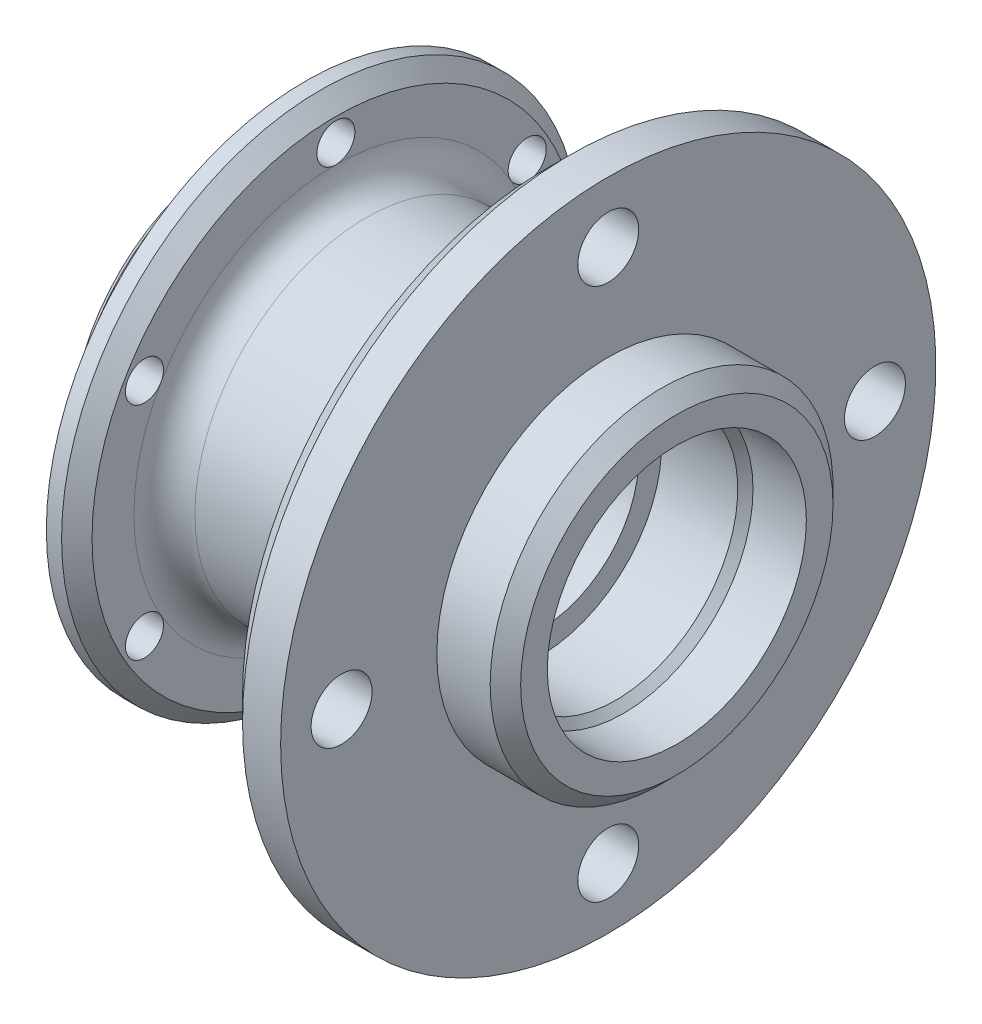
ISO-10303-21;
HEADER;
FILE_DESCRIPTION(('STEP AP214'),'2;1');
FILE_NAME('part.step','',(''),(''),'','','');
FILE_SCHEMA(('AUTOMOTIVE_DESIGN { 1 0 10303 214 1 1 1 1 }'));
ENDSEC;
DATA;
#1=APPLICATION_CONTEXT('core data for automotive mechanical design processes');
#2=APPLICATION_PROTOCOL_DEFINITION('international standard','automotive_design',2000,#1);
#3=PRODUCT_CONTEXT('',#1,'mechanical');
#4=PRODUCT('Part','Part','',(#3));
#5=PRODUCT_RELATED_PRODUCT_CATEGORY('part','',(#4));
#6=PRODUCT_DEFINITION_FORMATION('','',#4);
#7=PRODUCT_DEFINITION_CONTEXT('part definition',#1,'design');
#8=PRODUCT_DEFINITION('design','',#6,#7);
#9=PRODUCT_DEFINITION_SHAPE('','',#8);
#10=(LENGTH_UNIT() NAMED_UNIT(*) SI_UNIT(.MILLI.,.METRE.));
#11=(NAMED_UNIT(*) PLANE_ANGLE_UNIT() SI_UNIT($,.RADIAN.));
#12=(NAMED_UNIT(*) SI_UNIT($,.STERADIAN.) SOLID_ANGLE_UNIT());
#13=UNCERTAINTY_MEASURE_WITH_UNIT(LENGTH_MEASURE(1.E-05),#10,'distance_accuracy_value','');
#14=(GEOMETRIC_REPRESENTATION_CONTEXT(3) GLOBAL_UNCERTAINTY_ASSIGNED_CONTEXT((#13)) GLOBAL_UNIT_ASSIGNED_CONTEXT((#10,
#11,#12)) REPRESENTATION_CONTEXT('',''));
#15=CARTESIAN_POINT('',(0.,0.,0.));
#16=DIRECTION('',(0.,0.,1.));
#17=DIRECTION('',(1.,0.,0.));
#18=AXIS2_PLACEMENT_3D('',#15,#16,#17);
#19=CARTESIAN_POINT('',(-20.8689987087295,34.,0.));
#20=DIRECTION('',(1.,0.,0.));
#21=DIRECTION('',(0.,0.,-1.));
#22=AXIS2_PLACEMENT_3D('',#19,#20,#21);
#23=PLANE('',#22);
#24=CARTESIAN_POINT('',(-20.8689987087295,14.5000000000003,-25.1147367097486));
#25=DIRECTION('',(-1.,0.,0.));
#26=DIRECTION('',(0.,0.,1.));
#27=AXIS2_PLACEMENT_3D('',#24,#25,#26);
#28=CIRCLE('',#27,2.5);
#29=CARTESIAN_POINT('',(-20.8689987087295,14.5000000000003,-22.6147367097486));
#30=VERTEX_POINT('',#29);
#31=EDGE_CURVE('E246',#30,#30,#28,.T.);
#32=ORIENTED_EDGE('',*,*,#31,.F.);
#33=EDGE_LOOP('',(#32));
#34=FACE_BOUND('',#33,.T.);
#35=CARTESIAN_POINT('',(-20.8689987087295,-14.4999999999998,-25.1147367097489));
#36=DIRECTION('',(-1.,0.,0.));
#37=DIRECTION('',(0.,0.,1.));
#38=AXIS2_PLACEMENT_3D('',#35,#36,#37);
#39=CIRCLE('',#38,2.5);
#40=CARTESIAN_POINT('',(-20.8689987087295,-14.4999999999998,-22.6147367097489));
#41=VERTEX_POINT('',#40);
#42=EDGE_CURVE('E242',#41,#41,#39,.T.);
#43=ORIENTED_EDGE('',*,*,#42,.F.);
#44=EDGE_LOOP('',(#43));
#45=FACE_BOUND('',#44,.T.);
#46=CARTESIAN_POINT('',(-20.8689987087295,-29.,0.));
#47=DIRECTION('',(-1.,0.,0.));
#48=DIRECTION('',(0.,0.,1.));
#49=AXIS2_PLACEMENT_3D('',#46,#47,#48);
#50=CIRCLE('',#49,2.5);
#51=CARTESIAN_POINT('',(-20.8689987087295,-29.,2.5));
#52=VERTEX_POINT('',#51);
#53=EDGE_CURVE('E237',#52,#52,#50,.T.);
#54=ORIENTED_EDGE('',*,*,#53,.F.);
#55=EDGE_LOOP('',(#54));
#56=FACE_BOUND('',#55,.T.);
#57=CARTESIAN_POINT('',(-20.8689987087295,-14.5000000000001,25.1147367097487));
#58=DIRECTION('',(-1.,0.,0.));
#59=DIRECTION('',(0.,0.,1.));
#60=AXIS2_PLACEMENT_3D('',#57,#58,#59);
#61=CIRCLE('',#60,2.5);
#62=CARTESIAN_POINT('',(-20.8689987087295,-14.5000000000001,27.6147367097487));
#63=VERTEX_POINT('',#62);
#64=EDGE_CURVE('E229',#63,#63,#61,.T.);
#65=ORIENTED_EDGE('',*,*,#64,.F.);
#66=EDGE_LOOP('',(#65));
#67=FACE_BOUND('',#66,.T.);
#68=CARTESIAN_POINT('',(-20.8689987087295,29.,0.));
#69=DIRECTION('',(-1.,0.,0.));
#70=DIRECTION('',(0.,0.,1.));
#71=AXIS2_PLACEMENT_3D('',#68,#69,#70);
#72=CIRCLE('',#71,2.5);
#73=CARTESIAN_POINT('',(-20.8689987087295,29.,2.5));
#74=VERTEX_POINT('',#73);
#75=EDGE_CURVE('E88',#74,#74,#72,.T.);
#76=ORIENTED_EDGE('',*,*,#75,.F.);
#77=EDGE_LOOP('',(#76));
#78=FACE_BOUND('',#77,.T.);
#79=CARTESIAN_POINT('',(-20.8689987087295,0.,0.));
#80=DIRECTION('',(-1.,0.,0.));
#81=DIRECTION('',(0.,0.,1.));
#82=AXIS2_PLACEMENT_3D('',#79,#80,#81);
#83=CIRCLE('',#82,22.5);
#84=CARTESIAN_POINT('',(-20.8689987087295,0.,22.5));
#85=VERTEX_POINT('',#84);
#86=EDGE_CURVE('E126',#85,#85,#83,.T.);
#87=ORIENTED_EDGE('',*,*,#86,.F.);
#88=EDGE_LOOP('',(#87));
#89=FACE_BOUND('',#88,.T.);
#90=CARTESIAN_POINT('',(-20.8689987087295,0.,0.));
#91=DIRECTION('',(-1.,0.,0.));
#92=DIRECTION('',(0.,0.,1.));
#93=AXIS2_PLACEMENT_3D('',#90,#91,#92);
#94=CIRCLE('',#93,34.);
#95=CARTESIAN_POINT('',(-20.8689987087295,0.,34.));
#96=VERTEX_POINT('',#95);
#97=EDGE_CURVE('E129',#96,#96,#94,.T.);
#98=ORIENTED_EDGE('',*,*,#97,.T.);
#99=EDGE_LOOP('',(#98));
#100=FACE_BOUND('',#99,.T.);
#101=CARTESIAN_POINT('',(-20.8689987087295,14.4999999999999,25.1147367097488));
#102=DIRECTION('',(-1.,0.,0.));
#103=DIRECTION('',(0.,0.,1.));
#104=AXIS2_PLACEMENT_3D('',#101,#102,#103);
#105=CIRCLE('',#104,2.5);
#106=CARTESIAN_POINT('',(-20.8689987087295,14.4999999999999,27.6147367097488));
#107=VERTEX_POINT('',#106);
#108=EDGE_CURVE('E224',#107,#107,#105,.T.);
#109=ORIENTED_EDGE('',*,*,#108,.F.);
#110=EDGE_LOOP('',(#109));
#111=FACE_BOUND('',#110,.T.);
#112=ADVANCED_FACE('F35',(#34,#45,#56,#67,#78,#89,#100,#111),#23,.F.);
#113=CARTESIAN_POINT('',(18.8810012912705,22.5,0.));
#114=DIRECTION('',(-1.,0.,0.));
#115=DIRECTION('',(0.,0.,1.));
#116=AXIS2_PLACEMENT_3D('',#113,#114,#115);
#117=PLANE('',#116);
#118=CARTESIAN_POINT('',(18.8810012912705,35.,0.));
#119=DIRECTION('',(1.,0.,0.));
#120=DIRECTION('',(0.,0.,-1.));
#121=AXIS2_PLACEMENT_3D('',#118,#119,#120);
#122=CIRCLE('',#121,4.);
#123=CARTESIAN_POINT('',(18.8810012912705,35.,-4.));
#124=VERTEX_POINT('',#123);
#125=EDGE_CURVE('E111',#124,#124,#122,.T.);
#126=ORIENTED_EDGE('',*,*,#125,.F.);
#127=EDGE_LOOP('',(#126));
#128=FACE_BOUND('',#127,.T.);
#129=CARTESIAN_POINT('',(18.8810012912705,0.,0.));
#130=DIRECTION('',(-1.,0.,0.));
#131=DIRECTION('',(0.,0.,1.));
#132=AXIS2_PLACEMENT_3D('',#129,#130,#131);
#133=CIRCLE('',#132,43.);
#134=CARTESIAN_POINT('',(18.8810012912705,0.,43.));
#135=VERTEX_POINT('',#134);
#136=EDGE_CURVE('E152',#135,#135,#133,.T.);
#137=ORIENTED_EDGE('',*,*,#136,.F.);
#138=EDGE_LOOP('',(#137));
#139=FACE_BOUND('',#138,.T.);
#140=CARTESIAN_POINT('',(18.8810012912705,0.,0.));
#141=DIRECTION('',(-1.,0.,0.));
#142=DIRECTION('',(0.,0.,1.));
#143=AXIS2_PLACEMENT_3D('',#140,#141,#142);
#144=CIRCLE('',#143,22.5);
#145=CARTESIAN_POINT('',(18.8810012912705,0.,22.5));
#146=VERTEX_POINT('',#145);
#147=EDGE_CURVE('E155',#146,#146,#144,.T.);
#148=ORIENTED_EDGE('',*,*,#147,.T.);
#149=EDGE_LOOP('',(#148));
#150=FACE_BOUND('',#149,.T.);
#151=CARTESIAN_POINT('',(18.8810012912705,-1.2220184685951E-13,-35.));
#152=DIRECTION('',(1.,0.,0.));
#153=DIRECTION('',(0.,0.,-1.));
#154=AXIS2_PLACEMENT_3D('',#151,#152,#153);
#155=CIRCLE('',#154,4.);
#156=CARTESIAN_POINT('',(18.8810012912705,-1.2220184685951E-13,-39.));
#157=VERTEX_POINT('',#156);
#158=EDGE_CURVE('E105',#157,#157,#155,.T.);
#159=ORIENTED_EDGE('',*,*,#158,.F.);
#160=EDGE_LOOP('',(#159));
#161=FACE_BOUND('',#160,.T.);
#162=CARTESIAN_POINT('',(18.8810012912705,-35.,0.));
#163=DIRECTION('',(1.,0.,0.));
#164=DIRECTION('',(0.,0.,-1.));
#165=AXIS2_PLACEMENT_3D('',#162,#163,#164);
#166=CIRCLE('',#165,4.);
#167=CARTESIAN_POINT('',(18.8810012912705,-35.,-4.));
#168=VERTEX_POINT('',#167);
#169=EDGE_CURVE('E99',#168,#168,#166,.T.);
#170=ORIENTED_EDGE('',*,*,#169,.F.);
#171=EDGE_LOOP('',(#170));
#172=FACE_BOUND('',#171,.T.);
#173=CARTESIAN_POINT('',(18.8810012912705,3.66605540578529E-13,35.));
#174=DIRECTION('',(1.,0.,0.));
#175=DIRECTION('',(0.,0.,-1.));
#176=AXIS2_PLACEMENT_3D('',#173,#174,#175);
#177=CIRCLE('',#176,4.);
#178=CARTESIAN_POINT('',(18.8810012912705,3.66605540578529E-13,31.));
#179=VERTEX_POINT('',#178);
#180=EDGE_CURVE('E87',#179,#179,#177,.T.);
#181=ORIENTED_EDGE('',*,*,#180,.F.);
#182=EDGE_LOOP('',(#181));
#183=FACE_BOUND('',#182,.T.);
#184=ADVANCED_FACE('F193',(#128,#139,#150,#161,#172,#183),#117,.F.);
#185=CARTESIAN_POINT('',(-30.1189987087295,0.,0.));
#186=DIRECTION('',(-1.,0.,0.));
#187=DIRECTION('',(0.,0.,1.));
#188=AXIS2_PLACEMENT_3D('',#185,#186,#187);
#189=CONICAL_SURFACE('',#188,17.,0.785398163397448);
#190=CARTESIAN_POINT('',(-29.1189987087295,0.,0.));
#191=DIRECTION('',(-1.,0.,0.));
#192=DIRECTION('',(0.,0.,1.));
#193=AXIS2_PLACEMENT_3D('',#190,#191,#192);
#194=CIRCLE('',#193,16.);
#195=CARTESIAN_POINT('',(-29.1189987087295,0.,16.));
#196=VERTEX_POINT('',#195);
#197=EDGE_CURVE('E11',#196,#196,#194,.T.);
#198=ORIENTED_EDGE('',*,*,#197,.F.);
#199=EDGE_LOOP('',(#198));
#200=FACE_BOUND('',#199,.T.);
#201=CARTESIAN_POINT('',(-30.1189987087295,0.,0.));
#202=DIRECTION('',(-1.,0.,0.));
#203=DIRECTION('',(0.,0.,1.));
#204=AXIS2_PLACEMENT_3D('',#201,#202,#203);
#205=CIRCLE('',#204,17.);
#206=CARTESIAN_POINT('',(-30.1189987087295,0.,17.));
#207=VERTEX_POINT('',#206);
#208=EDGE_CURVE('E117',#207,#207,#205,.T.);
#209=ORIENTED_EDGE('',*,*,#208,.T.);
#210=EDGE_LOOP('',(#209));
#211=FACE_BOUND('',#210,.T.);
#212=ADVANCED_FACE('F37',(#200,#211),#189,.F.);
#213=CARTESIAN_POINT('',(-29.4546902840373,0.,0.));
#214=DIRECTION('',(-1.,0.,0.));
#215=DIRECTION('',(0.,0.,1.));
#216=AXIS2_PLACEMENT_3D('',#213,#214,#215);
#217=CYLINDRICAL_SURFACE('',#216,16.);
#218=CARTESIAN_POINT('',(-20.1189987087295,0.,0.));
#219=DIRECTION('',(-1.,0.,0.));
#220=DIRECTION('',(0.,0.,1.));
#221=AXIS2_PLACEMENT_3D('',#218,#219,#220);
#222=CIRCLE('',#221,16.);
#223=CARTESIAN_POINT('',(-20.1189987087295,0.,16.));
#224=VERTEX_POINT('',#223);
#225=EDGE_CURVE('E43',#224,#224,#222,.T.);
#226=ORIENTED_EDGE('',*,*,#225,.F.);
#227=EDGE_LOOP('',(#226));
#228=FACE_BOUND('',#227,.T.);
#229=ORIENTED_EDGE('',*,*,#197,.T.);
#230=EDGE_LOOP('',(#229));
#231=FACE_BOUND('',#230,.T.);
#232=ADVANCED_FACE('F186',(#228,#231),#217,.F.);
#233=CARTESIAN_POINT('',(-20.1189987087295,16.,0.));
#234=DIRECTION('',(1.,0.,0.));
#235=DIRECTION('',(0.,0.,-1.));
#236=AXIS2_PLACEMENT_3D('',#233,#234,#235);
#237=PLANE('',#236);
#238=CARTESIAN_POINT('',(-20.1189987087295,0.,0.));
#239=DIRECTION('',(-1.,0.,0.));
#240=DIRECTION('',(0.,0.,1.));
#241=AXIS2_PLACEMENT_3D('',#238,#239,#240);
#242=CIRCLE('',#241,13.);
#243=CARTESIAN_POINT('',(-20.1189987087295,0.,13.));
#244=VERTEX_POINT('',#243);
#245=EDGE_CURVE('E179',#244,#244,#242,.T.);
#246=ORIENTED_EDGE('',*,*,#245,.F.);
#247=EDGE_LOOP('',(#246));
#248=FACE_BOUND('',#247,.T.);
#249=ORIENTED_EDGE('',*,*,#225,.T.);
#250=EDGE_LOOP('',(#249));
#251=FACE_BOUND('',#250,.T.);
#252=ADVANCED_FACE('F184',(#248,#251),#237,.F.);
#253=CARTESIAN_POINT('',(-29.4546902840373,0.,0.));
#254=DIRECTION('',(-1.,0.,0.));
#255=DIRECTION('',(0.,0.,1.));
#256=AXIS2_PLACEMENT_3D('',#253,#254,#255);
#257=CYLINDRICAL_SURFACE('',#256,13.);
#258=CARTESIAN_POINT('',(9.88100129127047,0.,0.));
#259=DIRECTION('',(-1.,0.,0.));
#260=DIRECTION('',(0.,0.,1.));
#261=AXIS2_PLACEMENT_3D('',#258,#259,#260);
#262=CIRCLE('',#261,13.);
#263=CARTESIAN_POINT('',(9.88100129127047,0.,13.));
#264=VERTEX_POINT('',#263);
#265=EDGE_CURVE('E176',#264,#264,#262,.T.);
#266=ORIENTED_EDGE('',*,*,#265,.F.);
#267=EDGE_LOOP('',(#266));
#268=FACE_BOUND('',#267,.T.);
#269=ORIENTED_EDGE('',*,*,#245,.T.);
#270=EDGE_LOOP('',(#269));
#271=FACE_BOUND('',#270,.T.);
#272=ADVANCED_FACE('F348',(#268,#271),#257,.F.);
#273=CARTESIAN_POINT('',(9.88100129127047,13.,0.));
#274=DIRECTION('',(-1.,0.,0.));
#275=DIRECTION('',(0.,0.,1.));
#276=AXIS2_PLACEMENT_3D('',#273,#274,#275);
#277=PLANE('',#276);
#278=CARTESIAN_POINT('',(9.88100129127047,0.,0.));
#279=DIRECTION('',(-1.,0.,0.));
#280=DIRECTION('',(0.,0.,1.));
#281=AXIS2_PLACEMENT_3D('',#278,#279,#280);
#282=CIRCLE('',#281,16.);
#283=CARTESIAN_POINT('',(9.88100129127047,0.,16.));
#284=VERTEX_POINT('',#283);
#285=EDGE_CURVE('E173',#284,#284,#282,.T.);
#286=ORIENTED_EDGE('',*,*,#285,.F.);
#287=EDGE_LOOP('',(#286));
#288=FACE_BOUND('',#287,.T.);
#289=ORIENTED_EDGE('',*,*,#265,.T.);
#290=EDGE_LOOP('',(#289));
#291=FACE_BOUND('',#290,.T.);
#292=ADVANCED_FACE('F344',(#288,#291),#277,.F.);
#293=CARTESIAN_POINT('',(-29.4546902840373,0.,0.));
#294=DIRECTION('',(-1.,0.,0.));
#295=DIRECTION('',(0.,0.,1.));
#296=AXIS2_PLACEMENT_3D('',#293,#294,#295);
#297=CYLINDRICAL_SURFACE('',#296,16.);
#298=CARTESIAN_POINT('',(19.8810012912705,0.,0.));
#299=DIRECTION('',(-1.,0.,0.));
#300=DIRECTION('',(0.,0.,1.));
#301=AXIS2_PLACEMENT_3D('',#298,#299,#300);
#302=CIRCLE('',#301,16.);
#303=CARTESIAN_POINT('',(19.8810012912705,0.,16.));
#304=VERTEX_POINT('',#303);
#305=EDGE_CURVE('E170',#304,#304,#302,.T.);
#306=ORIENTED_EDGE('',*,*,#305,.F.);
#307=EDGE_LOOP('',(#306));
#308=FACE_BOUND('',#307,.T.);
#309=ORIENTED_EDGE('',*,*,#285,.T.);
#310=EDGE_LOOP('',(#309));
#311=FACE_BOUND('',#310,.T.);
#312=ADVANCED_FACE('F340',(#308,#311),#297,.F.);
#313=CARTESIAN_POINT('',(19.8810012912705,0.,0.));
#314=DIRECTION('',(1.,0.,0.));
#315=DIRECTION('',(0.,0.,-1.));
#316=AXIS2_PLACEMENT_3D('',#313,#314,#315);
#317=CONICAL_SURFACE('',#316,16.,0.785398163397452);
#318=CARTESIAN_POINT('',(20.8810012912705,0.,0.));
#319=DIRECTION('',(-1.,0.,0.));
#320=DIRECTION('',(0.,0.,1.));
#321=AXIS2_PLACEMENT_3D('',#318,#319,#320);
#322=CIRCLE('',#321,17.);
#323=CARTESIAN_POINT('',(20.8810012912705,0.,17.));
#324=VERTEX_POINT('',#323);
#325=EDGE_CURVE('E167',#324,#324,#322,.T.);
#326=ORIENTED_EDGE('',*,*,#325,.F.);
#327=EDGE_LOOP('',(#326));
#328=FACE_BOUND('',#327,.T.);
#329=ORIENTED_EDGE('',*,*,#305,.T.);
#330=EDGE_LOOP('',(#329));
#331=FACE_BOUND('',#330,.T.);
#332=ADVANCED_FACE('F336',(#328,#331),#317,.F.);
#333=CARTESIAN_POINT('',(-29.4546902840373,0.,0.));
#334=DIRECTION('',(-1.,0.,0.));
#335=DIRECTION('',(0.,0.,1.));
#336=AXIS2_PLACEMENT_3D('',#333,#334,#335);
#337=CYLINDRICAL_SURFACE('',#336,17.);
#338=CARTESIAN_POINT('',(27.8810012912705,0.,0.));
#339=DIRECTION('',(-1.,0.,0.));
#340=DIRECTION('',(0.,0.,1.));
#341=AXIS2_PLACEMENT_3D('',#338,#339,#340);
#342=CIRCLE('',#341,17.);
#343=CARTESIAN_POINT('',(27.8810012912705,0.,17.));
#344=VERTEX_POINT('',#343);
#345=EDGE_CURVE('E164',#344,#344,#342,.T.);
#346=ORIENTED_EDGE('',*,*,#345,.F.);
#347=EDGE_LOOP('',(#346));
#348=FACE_BOUND('',#347,.T.);
#349=ORIENTED_EDGE('',*,*,#325,.T.);
#350=EDGE_LOOP('',(#349));
#351=FACE_BOUND('',#350,.T.);
#352=ADVANCED_FACE('F332',(#348,#351),#337,.F.);
#353=CARTESIAN_POINT('',(27.8810012912705,17.,0.));
#354=DIRECTION('',(-1.,0.,0.));
#355=DIRECTION('',(0.,0.,1.));
#356=AXIS2_PLACEMENT_3D('',#353,#354,#355);
#357=PLANE('',#356);
#358=CARTESIAN_POINT('',(27.8810012912705,0.,0.));
#359=DIRECTION('',(-1.,0.,0.));
#360=DIRECTION('',(0.,0.,1.));
#361=AXIS2_PLACEMENT_3D('',#358,#359,#360);
#362=CIRCLE('',#361,20.5);
#363=CARTESIAN_POINT('',(27.8810012912705,0.,20.5));
#364=VERTEX_POINT('',#363);
#365=EDGE_CURVE('E161',#364,#364,#362,.T.);
#366=ORIENTED_EDGE('',*,*,#365,.F.);
#367=EDGE_LOOP('',(#366));
#368=FACE_BOUND('',#367,.T.);
#369=ORIENTED_EDGE('',*,*,#345,.T.);
#370=EDGE_LOOP('',(#369));
#371=FACE_BOUND('',#370,.T.);
#372=ADVANCED_FACE('F328',(#368,#371),#357,.F.);
#373=CARTESIAN_POINT('',(27.8810012912705,0.,0.));
#374=DIRECTION('',(-1.,0.,0.));
#375=DIRECTION('',(0.,0.,1.));
#376=AXIS2_PLACEMENT_3D('',#373,#374,#375);
#377=CONICAL_SURFACE('',#376,20.5,0.785398163397449);
#378=CARTESIAN_POINT('',(25.8810012912705,0.,0.));
#379=DIRECTION('',(-1.,0.,0.));
#380=DIRECTION('',(0.,0.,1.));
#381=AXIS2_PLACEMENT_3D('',#378,#379,#380);
#382=CIRCLE('',#381,22.5);
#383=CARTESIAN_POINT('',(25.8810012912705,0.,22.5));
#384=VERTEX_POINT('',#383);
#385=EDGE_CURVE('E158',#384,#384,#382,.T.);
#386=ORIENTED_EDGE('',*,*,#385,.F.);
#387=EDGE_LOOP('',(#386));
#388=FACE_BOUND('',#387,.T.);
#389=ORIENTED_EDGE('',*,*,#365,.T.);
#390=EDGE_LOOP('',(#389));
#391=FACE_BOUND('',#390,.T.);
#392=ADVANCED_FACE('F324',(#388,#391),#377,.T.);
#393=CARTESIAN_POINT('',(-29.4546902840373,0.,0.));
#394=DIRECTION('',(-1.,0.,0.));
#395=DIRECTION('',(0.,0.,1.));
#396=AXIS2_PLACEMENT_3D('',#393,#394,#395);
#397=CYLINDRICAL_SURFACE('',#396,22.5);
#398=ORIENTED_EDGE('',*,*,#147,.F.);
#399=EDGE_LOOP('',(#398));
#400=FACE_BOUND('',#399,.T.);
#401=ORIENTED_EDGE('',*,*,#385,.T.);
#402=EDGE_LOOP('',(#401));
#403=FACE_BOUND('',#402,.T.);
#404=ADVANCED_FACE('F317',(#400,#403),#397,.T.);
#405=CARTESIAN_POINT('',(-29.4546902840373,0.,0.));
#406=DIRECTION('',(-1.,0.,0.));
#407=DIRECTION('',(0.,0.,1.));
#408=AXIS2_PLACEMENT_3D('',#405,#406,#407);
#409=CYLINDRICAL_SURFACE('',#408,43.);
#410=CARTESIAN_POINT('',(13.8810012912705,0.,0.));
#411=DIRECTION('',(-1.,0.,0.));
#412=DIRECTION('',(0.,0.,1.));
#413=AXIS2_PLACEMENT_3D('',#410,#411,#412);
#414=CIRCLE('',#413,43.);
#415=CARTESIAN_POINT('',(13.8810012912705,0.,43.));
#416=VERTEX_POINT('',#415);
#417=EDGE_CURVE('E149',#416,#416,#414,.T.);
#418=ORIENTED_EDGE('',*,*,#417,.F.);
#419=EDGE_LOOP('',(#418));
#420=FACE_BOUND('',#419,.T.);
#421=ORIENTED_EDGE('',*,*,#136,.T.);
#422=EDGE_LOOP('',(#421));
#423=FACE_BOUND('',#422,.T.);
#424=ADVANCED_FACE('F313',(#420,#423),#409,.T.);
#425=CARTESIAN_POINT('',(13.8810012912705,0.,0.));
#426=DIRECTION('',(1.,0.,0.));
#427=DIRECTION('',(0.,0.,-1.));
#428=AXIS2_PLACEMENT_3D('',#425,#426,#427);
#429=CONICAL_SURFACE('',#428,43.,0.78539816339745);
#430=CARTESIAN_POINT('',(10.8810012912705,0.,0.));
#431=DIRECTION('',(-1.,0.,0.));
#432=DIRECTION('',(0.,0.,1.));
#433=AXIS2_PLACEMENT_3D('',#430,#431,#432);
#434=CIRCLE('',#433,40.);
#435=CARTESIAN_POINT('',(10.8810012912705,0.,40.));
#436=VERTEX_POINT('',#435);
#437=EDGE_CURVE('E146',#436,#436,#434,.T.);
#438=ORIENTED_EDGE('',*,*,#437,.F.);
#439=EDGE_LOOP('',(#438));
#440=FACE_BOUND('',#439,.T.);
#441=ORIENTED_EDGE('',*,*,#417,.T.);
#442=EDGE_LOOP('',(#441));
#443=FACE_BOUND('',#442,.T.);
#444=ADVANCED_FACE('F309',(#440,#443),#429,.T.);
#445=CARTESIAN_POINT('',(10.8810012912705,40.,0.));
#446=DIRECTION('',(1.,0.,0.));
#447=DIRECTION('',(0.,0.,-1.));
#448=AXIS2_PLACEMENT_3D('',#445,#446,#447);
#449=PLANE('',#448);
#450=CARTESIAN_POINT('',(10.8810012912705,3.66605540578529E-13,35.));
#451=DIRECTION('',(1.,0.,0.));
#452=DIRECTION('',(0.,0.,-1.));
#453=AXIS2_PLACEMENT_3D('',#450,#451,#452);
#454=CIRCLE('',#453,4.);
#455=CARTESIAN_POINT('',(10.8810012912705,3.66605540578529E-13,31.));
#456=VERTEX_POINT('',#455);
#457=EDGE_CURVE('E91',#456,#456,#454,.T.);
#458=ORIENTED_EDGE('',*,*,#457,.T.);
#459=EDGE_LOOP('',(#458));
#460=FACE_BOUND('',#459,.T.);
#461=CARTESIAN_POINT('',(10.8810012912705,-35.,0.));
#462=DIRECTION('',(1.,0.,0.));
#463=DIRECTION('',(0.,0.,-1.));
#464=AXIS2_PLACEMENT_3D('',#461,#462,#463);
#465=CIRCLE('',#464,4.);
#466=CARTESIAN_POINT('',(10.8810012912705,-35.,-4.));
#467=VERTEX_POINT('',#466);
#468=EDGE_CURVE('E102',#467,#467,#465,.T.);
#469=ORIENTED_EDGE('',*,*,#468,.T.);
#470=EDGE_LOOP('',(#469));
#471=FACE_BOUND('',#470,.T.);
#472=CARTESIAN_POINT('',(10.8810012912705,-1.2220184685951E-13,-35.));
#473=DIRECTION('',(1.,0.,0.));
#474=DIRECTION('',(0.,0.,-1.));
#475=AXIS2_PLACEMENT_3D('',#472,#473,#474);
#476=CIRCLE('',#475,4.);
#477=CARTESIAN_POINT('',(10.8810012912705,-1.2220184685951E-13,-39.));
#478=VERTEX_POINT('',#477);
#479=EDGE_CURVE('E108',#478,#478,#476,.T.);
#480=ORIENTED_EDGE('',*,*,#479,.T.);
#481=EDGE_LOOP('',(#480));
#482=FACE_BOUND('',#481,.T.);
#483=CARTESIAN_POINT('',(10.8810012912705,35.,0.));
#484=DIRECTION('',(1.,0.,0.));
#485=DIRECTION('',(0.,0.,-1.));
#486=AXIS2_PLACEMENT_3D('',#483,#484,#485);
#487=CIRCLE('',#486,4.);
#488=CARTESIAN_POINT('',(10.8810012912705,35.,-4.));
#489=VERTEX_POINT('',#488);
#490=EDGE_CURVE('E114',#489,#489,#487,.T.);
#491=ORIENTED_EDGE('',*,*,#490,.T.);
#492=EDGE_LOOP('',(#491));
#493=FACE_BOUND('',#492,.T.);
#494=CARTESIAN_POINT('',(10.8810012912705,0.,0.));
#495=DIRECTION('',(-1.,0.,0.));
#496=DIRECTION('',(0.,0.,1.));
#497=AXIS2_PLACEMENT_3D('',#494,#495,#496);
#498=CIRCLE('',#497,26.5);
#499=CARTESIAN_POINT('',(10.8810012912705,0.,26.5));
#500=VERTEX_POINT('',#499);
#501=EDGE_CURVE('E143',#500,#500,#498,.T.);
#502=ORIENTED_EDGE('',*,*,#501,.F.);
#503=EDGE_LOOP('',(#502));
#504=FACE_BOUND('',#503,.T.);
#505=ORIENTED_EDGE('',*,*,#437,.T.);
#506=EDGE_LOOP('',(#505));
#507=FACE_BOUND('',#506,.T.);
#508=ADVANCED_FACE('F305',(#460,#471,#482,#493,#504,#507),#449,.F.);
#509=CARTESIAN_POINT('',(6.88100129127048,0.,0.));
#510=DIRECTION('',(-1.,0.,0.));
#511=DIRECTION('',(0.,0.,1.));
#512=AXIS2_PLACEMENT_3D('',#509,#510,#511);
#513=TOROIDAL_SURFACE('',#512,26.5,4.);
#514=CARTESIAN_POINT('',(6.88100129127045,0.,0.));
#515=DIRECTION('',(-1.,0.,0.));
#516=DIRECTION('',(0.,0.,1.));
#517=AXIS2_PLACEMENT_3D('',#514,#515,#516);
#518=CIRCLE('',#517,22.5);
#519=CARTESIAN_POINT('',(6.88100129127045,0.,22.5));
#520=VERTEX_POINT('',#519);
#521=EDGE_CURVE('E140',#520,#520,#518,.T.);
#522=ORIENTED_EDGE('',*,*,#521,.F.);
#523=EDGE_LOOP('',(#522));
#524=FACE_BOUND('',#523,.T.);
#525=ORIENTED_EDGE('',*,*,#501,.T.);
#526=EDGE_LOOP('',(#525));
#527=FACE_BOUND('',#526,.T.);
#528=ADVANCED_FACE('F301',(#524,#527),#513,.F.);
#529=CARTESIAN_POINT('',(-29.4546902840373,0.,0.));
#530=DIRECTION('',(-1.,0.,0.));
#531=DIRECTION('',(0.,0.,1.));
#532=AXIS2_PLACEMENT_3D('',#529,#530,#531);
#533=CYLINDRICAL_SURFACE('',#532,22.5);
#534=CARTESIAN_POINT('',(-12.8689987087295,0.,0.));
#535=DIRECTION('',(-1.,0.,0.));
#536=DIRECTION('',(0.,0.,1.));
#537=AXIS2_PLACEMENT_3D('',#534,#535,#536);
#538=CIRCLE('',#537,22.5);
#539=CARTESIAN_POINT('',(-12.8689987087295,0.,22.5));
#540=VERTEX_POINT('',#539);
#541=EDGE_CURVE('E137',#540,#540,#538,.T.);
#542=ORIENTED_EDGE('',*,*,#541,.F.);
#543=EDGE_LOOP('',(#542));
#544=FACE_BOUND('',#543,.T.);
#545=ORIENTED_EDGE('',*,*,#521,.T.);
#546=EDGE_LOOP('',(#545));
#547=FACE_BOUND('',#546,.T.);
#548=ADVANCED_FACE('F298',(#544,#547),#533,.T.);
#549=CARTESIAN_POINT('',(-12.8689987087295,0.,0.));
#550=DIRECTION('',(-1.,0.,0.));
#551=DIRECTION('',(0.,0.,1.));
#552=AXIS2_PLACEMENT_3D('',#549,#550,#551);
#553=TOROIDAL_SURFACE('',#552,26.5,4.);
#554=CARTESIAN_POINT('',(-16.8689987087295,0.,0.));
#555=DIRECTION('',(-1.,0.,0.));
#556=DIRECTION('',(0.,0.,1.));
#557=AXIS2_PLACEMENT_3D('',#554,#555,#556);
#558=CIRCLE('',#557,26.5);
#559=CARTESIAN_POINT('',(-16.8689987087295,26.5,0.));
#560=VERTEX_POINT('',#559);
#561=CARTESIAN_POINT('',(-16.8689987087295,13.2500000000003,-22.9496732002875));
#562=VERTEX_POINT('',#561);
#563=EDGE_CURVE('E83',#560,#562,#558,.T.);
#564=ORIENTED_EDGE('',*,*,#563,.F.);
#565=CARTESIAN_POINT('',(-16.8689987087295,13.25,22.9496732002877));
#566=VERTEX_POINT('',#565);
#567=EDGE_CURVE('E70',#566,#560,#558,.T.);
#568=ORIENTED_EDGE('',*,*,#567,.F.);
#569=CARTESIAN_POINT('',(-16.8689987087295,-13.2500000000001,22.9496732002876));
#570=VERTEX_POINT('',#569);
#571=EDGE_CURVE('E80',#570,#566,#558,.T.);
#572=ORIENTED_EDGE('',*,*,#571,.F.);
#573=CARTESIAN_POINT('',(-16.8689987087295,-26.5,0.));
#574=VERTEX_POINT('',#573);
#575=EDGE_CURVE('E583',#574,#570,#558,.T.);
#576=ORIENTED_EDGE('',*,*,#575,.F.);
#577=CARTESIAN_POINT('',(-16.8689987087295,-13.2499999999998,-22.9496732002878));
#578=VERTEX_POINT('',#577);
#579=EDGE_CURVE('E579',#578,#574,#558,.T.);
#580=ORIENTED_EDGE('',*,*,#579,.F.);
#581=EDGE_CURVE('E54',#562,#578,#558,.T.);
#582=ORIENTED_EDGE('',*,*,#581,.F.);
#583=EDGE_LOOP('',(#564,#568,#572,#576,#580,#582));
#584=FACE_BOUND('',#583,.T.);
#585=ORIENTED_EDGE('',*,*,#541,.T.);
#586=EDGE_LOOP('',(#585));
#587=FACE_BOUND('',#586,.T.);
#588=ADVANCED_FACE('F294',(#584,#587),#553,.F.);
#589=CARTESIAN_POINT('',(-16.8689987087295,32.,0.));
#590=DIRECTION('',(-1.,0.,0.));
#591=DIRECTION('',(0.,0.,1.));
#592=AXIS2_PLACEMENT_3D('',#589,#590,#591);
#593=PLANE('',#592);
#594=CARTESIAN_POINT('',(-16.8689987087295,0.,0.));
#595=DIRECTION('',(-1.,0.,0.));
#596=DIRECTION('',(0.,0.,1.));
#597=AXIS2_PLACEMENT_3D('',#594,#595,#596);
#598=CIRCLE('',#597,32.);
#599=CARTESIAN_POINT('',(-16.8689987087295,0.,32.));
#600=VERTEX_POINT('',#599);
#601=EDGE_CURVE('E81',#600,#600,#598,.T.);
#602=ORIENTED_EDGE('',*,*,#601,.F.);
#603=EDGE_LOOP('',(#602));
#604=FACE_BOUND('',#603,.T.);
#605=ORIENTED_EDGE('',*,*,#563,.T.);
#606=CARTESIAN_POINT('',(-16.8689987087295,14.5000000000003,-25.1147367097486));
#607=DIRECTION('',(-1.,0.,0.));
#608=DIRECTION('',(0.,0.,1.));
#609=AXIS2_PLACEMENT_3D('',#606,#607,#608);
#610=CIRCLE('',#609,2.5);
#611=EDGE_CURVE('E48',#562,#562,#610,.T.);
#612=ORIENTED_EDGE('',*,*,#611,.T.);
#613=ORIENTED_EDGE('',*,*,#581,.T.);
#614=CARTESIAN_POINT('',(-16.8689987087295,-14.4999999999998,-25.1147367097489));
#615=DIRECTION('',(-1.,0.,0.));
#616=DIRECTION('',(0.,0.,1.));
#617=AXIS2_PLACEMENT_3D('',#614,#615,#616);
#618=CIRCLE('',#617,2.5);
#619=EDGE_CURVE('E240',#578,#578,#618,.T.);
#620=ORIENTED_EDGE('',*,*,#619,.T.);
#621=ORIENTED_EDGE('',*,*,#579,.T.);
#622=CARTESIAN_POINT('',(-16.8689987087295,-29.,0.));
#623=DIRECTION('',(-1.,0.,0.));
#624=DIRECTION('',(0.,0.,1.));
#625=AXIS2_PLACEMENT_3D('',#622,#623,#624);
#626=CIRCLE('',#625,2.5);
#627=EDGE_CURVE('E234',#574,#574,#626,.T.);
#628=ORIENTED_EDGE('',*,*,#627,.T.);
#629=ORIENTED_EDGE('',*,*,#575,.T.);
#630=CARTESIAN_POINT('',(-16.8689987087295,-14.5000000000001,25.1147367097487));
#631=DIRECTION('',(-1.,0.,0.));
#632=DIRECTION('',(0.,0.,1.));
#633=AXIS2_PLACEMENT_3D('',#630,#631,#632);
#634=CIRCLE('',#633,2.5);
#635=EDGE_CURVE('E226',#570,#570,#634,.T.);
#636=ORIENTED_EDGE('',*,*,#635,.T.);
#637=ORIENTED_EDGE('',*,*,#571,.T.);
#638=CARTESIAN_POINT('',(-16.8689987087295,14.4999999999999,25.1147367097488));
#639=DIRECTION('',(-1.,0.,0.));
#640=DIRECTION('',(0.,0.,1.));
#641=AXIS2_PLACEMENT_3D('',#638,#639,#640);
#642=CIRCLE('',#641,2.5);
#643=EDGE_CURVE('E77',#566,#566,#642,.T.);
#644=ORIENTED_EDGE('',*,*,#643,.T.);
#645=ORIENTED_EDGE('',*,*,#567,.T.);
#646=CARTESIAN_POINT('',(-16.8689987087295,29.,0.));
#647=DIRECTION('',(-1.,0.,0.));
#648=DIRECTION('',(0.,0.,1.));
#649=AXIS2_PLACEMENT_3D('',#646,#647,#648);
#650=CIRCLE('',#649,2.5);
#651=EDGE_CURVE('E74',#560,#560,#650,.T.);
#652=ORIENTED_EDGE('',*,*,#651,.T.);
#653=EDGE_LOOP('',(#605,#612,#613,#620,#621,#628,#629,#636,#637,#644,#645,#652));
#654=FACE_BOUND('',#653,.T.);
#655=ADVANCED_FACE('F73',(#604,#654),#593,.F.);
#656=CARTESIAN_POINT('',(-16.8689987087295,0.,0.));
#657=DIRECTION('',(-1.,0.,0.));
#658=DIRECTION('',(0.,0.,1.));
#659=AXIS2_PLACEMENT_3D('',#656,#657,#658);
#660=CONICAL_SURFACE('',#659,32.,0.785398163397449);
#661=CARTESIAN_POINT('',(-18.8689987087295,0.,0.));
#662=DIRECTION('',(-1.,0.,0.));
#663=DIRECTION('',(0.,0.,1.));
#664=AXIS2_PLACEMENT_3D('',#661,#662,#663);
#665=CIRCLE('',#664,34.);
#666=CARTESIAN_POINT('',(-18.8689987087295,0.,34.));
#667=VERTEX_POINT('',#666);
#668=EDGE_CURVE('E132',#667,#667,#665,.T.);
#669=ORIENTED_EDGE('',*,*,#668,.F.);
#670=EDGE_LOOP('',(#669));
#671=FACE_BOUND('',#670,.T.);
#672=ORIENTED_EDGE('',*,*,#601,.T.);
#673=EDGE_LOOP('',(#672));
#674=FACE_BOUND('',#673,.T.);
#675=ADVANCED_FACE('F287',(#671,#674),#660,.T.);
#676=CARTESIAN_POINT('',(-29.4546902840373,0.,0.));
#677=DIRECTION('',(-1.,0.,0.));
#678=DIRECTION('',(0.,0.,1.));
#679=AXIS2_PLACEMENT_3D('',#676,#677,#678);
#680=CYLINDRICAL_SURFACE('',#679,34.);
#681=ORIENTED_EDGE('',*,*,#97,.F.);
#682=EDGE_LOOP('',(#681));
#683=FACE_BOUND('',#682,.T.);
#684=ORIENTED_EDGE('',*,*,#668,.T.);
#685=EDGE_LOOP('',(#684));
#686=FACE_BOUND('',#685,.T.);
#687=ADVANCED_FACE('F212',(#683,#686),#680,.T.);
#688=CARTESIAN_POINT('',(-29.4546902840373,0.,0.));
#689=DIRECTION('',(-1.,0.,0.));
#690=DIRECTION('',(0.,0.,1.));
#691=AXIS2_PLACEMENT_3D('',#688,#689,#690);
#692=CYLINDRICAL_SURFACE('',#691,22.5);
#693=CARTESIAN_POINT('',(-29.1189987087295,0.,0.));
#694=DIRECTION('',(-1.,0.,0.));
#695=DIRECTION('',(0.,0.,1.));
#696=AXIS2_PLACEMENT_3D('',#693,#694,#695);
#697=CIRCLE('',#696,22.5);
#698=CARTESIAN_POINT('',(-29.1189987087295,0.,22.5));
#699=VERTEX_POINT('',#698);
#700=EDGE_CURVE('E123',#699,#699,#697,.T.);
#701=ORIENTED_EDGE('',*,*,#700,.F.);
#702=EDGE_LOOP('',(#701));
#703=FACE_BOUND('',#702,.T.);
#704=ORIENTED_EDGE('',*,*,#86,.T.);
#705=EDGE_LOOP('',(#704));
#706=FACE_BOUND('',#705,.T.);
#707=ADVANCED_FACE('F206',(#703,#706),#692,.T.);
#708=CARTESIAN_POINT('',(-29.1189987087295,0.,0.));
#709=DIRECTION('',(1.,0.,0.));
#710=DIRECTION('',(0.,0.,-1.));
#711=AXIS2_PLACEMENT_3D('',#708,#709,#710);
#712=CONICAL_SURFACE('',#711,22.5,0.785398163397448);
#713=CARTESIAN_POINT('',(-30.1189987087295,0.,0.));
#714=DIRECTION('',(-1.,0.,0.));
#715=DIRECTION('',(0.,0.,1.));
#716=AXIS2_PLACEMENT_3D('',#713,#714,#715);
#717=CIRCLE('',#716,21.5);
#718=CARTESIAN_POINT('',(-30.1189987087295,0.,21.5));
#719=VERTEX_POINT('',#718);
#720=EDGE_CURVE('E120',#719,#719,#717,.T.);
#721=ORIENTED_EDGE('',*,*,#720,.F.);
#722=EDGE_LOOP('',(#721));
#723=FACE_BOUND('',#722,.T.);
#724=ORIENTED_EDGE('',*,*,#700,.T.);
#725=EDGE_LOOP('',(#724));
#726=FACE_BOUND('',#725,.T.);
#727=ADVANCED_FACE('F200',(#723,#726),#712,.T.);
#728=CARTESIAN_POINT('',(-30.1189987087295,17.,0.));
#729=DIRECTION('',(1.,0.,0.));
#730=DIRECTION('',(0.,0.,-1.));
#731=AXIS2_PLACEMENT_3D('',#728,#729,#730);
#732=PLANE('',#731);
#733=ORIENTED_EDGE('',*,*,#208,.F.);
#734=EDGE_LOOP('',(#733));
#735=FACE_BOUND('',#734,.T.);
#736=ORIENTED_EDGE('',*,*,#720,.T.);
#737=EDGE_LOOP('',(#736));
#738=FACE_BOUND('',#737,.T.);
#739=ADVANCED_FACE('F196',(#735,#738),#732,.F.);
#740=CARTESIAN_POINT('',(18.8810012912705,35.,0.));
#741=DIRECTION('',(1.,0.,0.));
#742=DIRECTION('',(0.,0.,-1.));
#743=AXIS2_PLACEMENT_3D('',#740,#741,#742);
#744=CYLINDRICAL_SURFACE('',#743,4.);
#745=ORIENTED_EDGE('',*,*,#490,.F.);
#746=EDGE_LOOP('',(#745));
#747=FACE_BOUND('',#746,.T.);
#748=ORIENTED_EDGE('',*,*,#125,.T.);
#749=EDGE_LOOP('',(#748));
#750=FACE_BOUND('',#749,.T.);
#751=ADVANCED_FACE('F199',(#747,#750),#744,.F.);
#752=CARTESIAN_POINT('',(18.8810012912705,-1.2220184685951E-13,-35.));
#753=DIRECTION('',(1.,0.,0.));
#754=DIRECTION('',(0.,0.,-1.));
#755=AXIS2_PLACEMENT_3D('',#752,#753,#754);
#756=CYLINDRICAL_SURFACE('',#755,4.);
#757=ORIENTED_EDGE('',*,*,#479,.F.);
#758=EDGE_LOOP('',(#757));
#759=FACE_BOUND('',#758,.T.);
#760=ORIENTED_EDGE('',*,*,#158,.T.);
#761=EDGE_LOOP('',(#760));
#762=FACE_BOUND('',#761,.T.);
#763=ADVANCED_FACE('F277',(#759,#762),#756,.F.);
#764=CARTESIAN_POINT('',(18.8810012912705,-35.,0.));
#765=DIRECTION('',(1.,0.,0.));
#766=DIRECTION('',(0.,0.,-1.));
#767=AXIS2_PLACEMENT_3D('',#764,#765,#766);
#768=CYLINDRICAL_SURFACE('',#767,4.);
#769=ORIENTED_EDGE('',*,*,#468,.F.);
#770=EDGE_LOOP('',(#769));
#771=FACE_BOUND('',#770,.T.);
#772=ORIENTED_EDGE('',*,*,#169,.T.);
#773=EDGE_LOOP('',(#772));
#774=FACE_BOUND('',#773,.T.);
#775=ADVANCED_FACE('F270',(#771,#774),#768,.F.);
#776=CARTESIAN_POINT('',(18.8810012912705,3.66605540578529E-13,35.));
#777=DIRECTION('',(1.,0.,0.));
#778=DIRECTION('',(0.,0.,-1.));
#779=AXIS2_PLACEMENT_3D('',#776,#777,#778);
#780=CYLINDRICAL_SURFACE('',#779,4.);
#781=ORIENTED_EDGE('',*,*,#457,.F.);
#782=EDGE_LOOP('',(#781));
#783=FACE_BOUND('',#782,.T.);
#784=ORIENTED_EDGE('',*,*,#180,.T.);
#785=EDGE_LOOP('',(#784));
#786=FACE_BOUND('',#785,.T.);
#787=ADVANCED_FACE('F261',(#783,#786),#780,.F.);
#788=CARTESIAN_POINT('',(-20.8689987087295,29.,0.));
#789=DIRECTION('',(-1.,0.,0.));
#790=DIRECTION('',(0.,0.,1.));
#791=AXIS2_PLACEMENT_3D('',#788,#789,#790);
#792=CYLINDRICAL_SURFACE('',#791,2.5);
#793=ORIENTED_EDGE('',*,*,#651,.F.);
#794=EDGE_LOOP('',(#793));
#795=FACE_BOUND('',#794,.T.);
#796=ORIENTED_EDGE('',*,*,#75,.T.);
#797=EDGE_LOOP('',(#796));
#798=FACE_BOUND('',#797,.T.);
#799=ADVANCED_FACE('F85',(#795,#798),#792,.F.);
#800=CARTESIAN_POINT('',(-20.8689987087295,14.4999999999999,25.1147367097488));
#801=DIRECTION('',(-1.,0.,0.));
#802=DIRECTION('',(0.,0.,1.));
#803=AXIS2_PLACEMENT_3D('',#800,#801,#802);
#804=CYLINDRICAL_SURFACE('',#803,2.5);
#805=ORIENTED_EDGE('',*,*,#643,.F.);
#806=EDGE_LOOP('',(#805));
#807=FACE_BOUND('',#806,.T.);
#808=ORIENTED_EDGE('',*,*,#108,.T.);
#809=EDGE_LOOP('',(#808));
#810=FACE_BOUND('',#809,.T.);
#811=ADVANCED_FACE('F260',(#807,#810),#804,.F.);
#812=CARTESIAN_POINT('',(-20.8689987087295,-14.5000000000001,25.1147367097487));
#813=DIRECTION('',(-1.,0.,0.));
#814=DIRECTION('',(0.,0.,1.));
#815=AXIS2_PLACEMENT_3D('',#812,#813,#814);
#816=CYLINDRICAL_SURFACE('',#815,2.5);
#817=ORIENTED_EDGE('',*,*,#635,.F.);
#818=EDGE_LOOP('',(#817));
#819=FACE_BOUND('',#818,.T.);
#820=ORIENTED_EDGE('',*,*,#64,.T.);
#821=EDGE_LOOP('',(#820));
#822=FACE_BOUND('',#821,.T.);
#823=ADVANCED_FACE('F267',(#819,#822),#816,.F.);
#824=CARTESIAN_POINT('',(-20.8689987087295,-29.,0.));
#825=DIRECTION('',(-1.,0.,0.));
#826=DIRECTION('',(0.,0.,1.));
#827=AXIS2_PLACEMENT_3D('',#824,#825,#826);
#828=CYLINDRICAL_SURFACE('',#827,2.5);
#829=ORIENTED_EDGE('',*,*,#627,.F.);
#830=EDGE_LOOP('',(#829));
#831=FACE_BOUND('',#830,.T.);
#832=ORIENTED_EDGE('',*,*,#53,.T.);
#833=EDGE_LOOP('',(#832));
#834=FACE_BOUND('',#833,.T.);
#835=ADVANCED_FACE('F546',(#831,#834),#828,.F.);
#836=CARTESIAN_POINT('',(-20.8689987087295,-14.4999999999998,-25.1147367097489));
#837=DIRECTION('',(-1.,0.,0.));
#838=DIRECTION('',(0.,0.,1.));
#839=AXIS2_PLACEMENT_3D('',#836,#837,#838);
#840=CYLINDRICAL_SURFACE('',#839,2.5);
#841=ORIENTED_EDGE('',*,*,#619,.F.);
#842=EDGE_LOOP('',(#841));
#843=FACE_BOUND('',#842,.T.);
#844=ORIENTED_EDGE('',*,*,#42,.T.);
#845=EDGE_LOOP('',(#844));
#846=FACE_BOUND('',#845,.T.);
#847=ADVANCED_FACE('F554',(#843,#846),#840,.F.);
#848=CARTESIAN_POINT('',(-20.8689987087295,14.5000000000003,-25.1147367097486));
#849=DIRECTION('',(-1.,0.,0.));
#850=DIRECTION('',(0.,0.,1.));
#851=AXIS2_PLACEMENT_3D('',#848,#849,#850);
#852=CYLINDRICAL_SURFACE('',#851,2.5);
#853=ORIENTED_EDGE('',*,*,#611,.F.);
#854=EDGE_LOOP('',(#853));
#855=FACE_BOUND('',#854,.T.);
#856=ORIENTED_EDGE('',*,*,#31,.T.);
#857=EDGE_LOOP('',(#856));
#858=FACE_BOUND('',#857,.T.);
#859=ADVANCED_FACE('F250',(#855,#858),#852,.F.);
#860=CLOSED_SHELL('',(#112,#184,#212,#232,#252,#272,#292,#312,#332,#352,#372,#392,#404,#424,
#444,#508,#528,#548,#588,#655,#675,#687,#707,#727,#739,#751,#763,#775,#787,#799,#811,#823,#835,
#847,#859));
#861=MANIFOLD_SOLID_BREP('B2',#860);
#862=ADVANCED_BREP_SHAPE_REPRESENTATION('',(#18,#861),#14);
#863=SHAPE_DEFINITION_REPRESENTATION(#9,#862);
ENDSEC;
END-ISO-10303-21;
